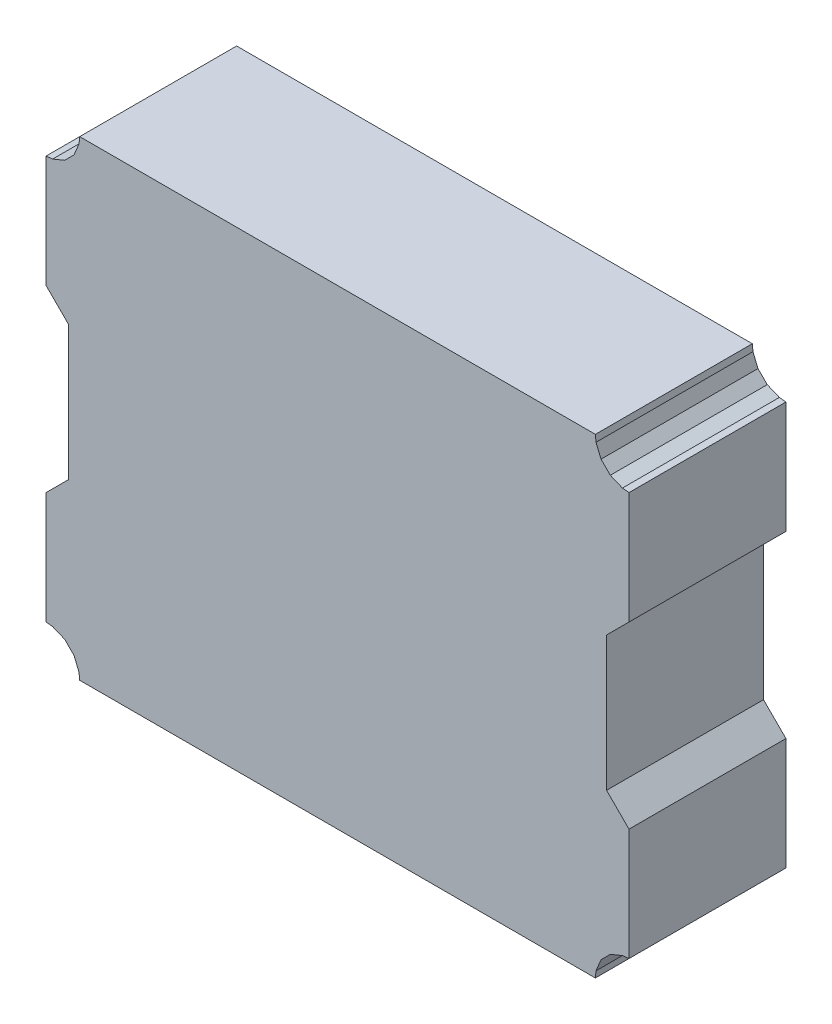
ISO-10303-21;
HEADER;
FILE_DESCRIPTION(('STEP AP214'),'2;1');
FILE_NAME('part.step','',(''),(''),'','','');
FILE_SCHEMA(('AUTOMOTIVE_DESIGN { 1 0 10303 214 1 1 1 1 }'));
ENDSEC;
DATA;
#1=APPLICATION_CONTEXT('core data for automotive mechanical design processes');
#2=APPLICATION_PROTOCOL_DEFINITION('international standard','automotive_design',2000,#1);
#3=PRODUCT_CONTEXT('',#1,'mechanical');
#4=PRODUCT('Part','Part','',(#3));
#5=PRODUCT_RELATED_PRODUCT_CATEGORY('part','',(#4));
#6=PRODUCT_DEFINITION_FORMATION('','',#4);
#7=PRODUCT_DEFINITION_CONTEXT('part definition',#1,'design');
#8=PRODUCT_DEFINITION('design','',#6,#7);
#9=PRODUCT_DEFINITION_SHAPE('','',#8);
#10=(LENGTH_UNIT() NAMED_UNIT(*) SI_UNIT(.MILLI.,.METRE.));
#11=(NAMED_UNIT(*) PLANE_ANGLE_UNIT() SI_UNIT($,.RADIAN.));
#12=(NAMED_UNIT(*) SI_UNIT($,.STERADIAN.) SOLID_ANGLE_UNIT());
#13=UNCERTAINTY_MEASURE_WITH_UNIT(LENGTH_MEASURE(1.E-05),#10,'distance_accuracy_value','');
#14=(GEOMETRIC_REPRESENTATION_CONTEXT(3) GLOBAL_UNCERTAINTY_ASSIGNED_CONTEXT((#13)) GLOBAL_UNIT_ASSIGNED_CONTEXT((#10,
#11,#12)) REPRESENTATION_CONTEXT('',''));
#15=CARTESIAN_POINT('',(0.,0.,0.));
#16=DIRECTION('',(0.,0.,1.));
#17=DIRECTION('',(1.,0.,0.));
#18=AXIS2_PLACEMENT_3D('',#15,#16,#17);
#19=CARTESIAN_POINT('',(-1.15000024,1.05000044,0.70000114));
#20=DIRECTION('',(0.,0.,1.));
#21=DIRECTION('',(1.,0.,0.));
#22=AXIS2_PLACEMENT_3D('',#19,#20,#21);
#23=PLANE('',#22);
#24=DIRECTION('',(-0.0980327133937617,-0.99518319273622,0.));
#25=VECTOR('',#24,1.);
#26=CARTESIAN_POINT('',(-1.15000024,1.05000044,0.70000114));
#27=LINE('',#26,#25);
#28=CARTESIAN_POINT('',(-1.15000024,1.05000044,0.70000114));
#29=VERTEX_POINT('',#28);
#30=CARTESIAN_POINT('',(-1.15288314,1.02073456,0.70000114));
#31=VERTEX_POINT('',#30);
#32=EDGE_CURVE('E679',#29,#31,#27,.T.);
#33=ORIENTED_EDGE('',*,*,#32,.T.);
#34=DIRECTION('',(-0.382691644263868,-0.923876130988682,0.));
#35=VECTOR('',#34,1.);
#36=CARTESIAN_POINT('',(-1.15288314,1.02073456,0.70000114));
#37=LINE('',#36,#35);
#38=CARTESIAN_POINT('',(-1.17528086,0.96666304,0.70000114));
#39=VERTEX_POINT('',#38);
#40=EDGE_CURVE('E650',#31,#39,#37,.T.);
#41=ORIENTED_EDGE('',*,*,#40,.T.);
#42=DIRECTION('',(-0.707106781185548,-0.707106781187548,0.));
#43=VECTOR('',#42,1.);
#44=CARTESIAN_POINT('',(-1.17528086,0.96666304,0.70000114));
#45=LINE('',#44,#43);
#46=CARTESIAN_POINT('',(-1.21666508,0.92527882,0.70000114));
#47=VERTEX_POINT('',#46);
#48=EDGE_CURVE('E577',#39,#47,#45,.T.);
#49=ORIENTED_EDGE('',*,*,#48,.T.);
#50=DIRECTION('',(-0.923876130989389,-0.382691644262162,0.));
#51=VECTOR('',#50,1.);
#52=CARTESIAN_POINT('',(-1.21666508,0.92527882,0.70000114));
#53=LINE('',#52,#51);
#54=CARTESIAN_POINT('',(-1.2707366,0.9028811,0.70000114));
#55=VERTEX_POINT('',#54);
#56=EDGE_CURVE('E587',#47,#55,#53,.T.);
#57=ORIENTED_EDGE('',*,*,#56,.T.);
#58=DIRECTION('',(-0.99519078692899,-0.097955589996989,0.));
#59=VECTOR('',#58,1.);
#60=CARTESIAN_POINT('',(-1.2707366,0.9028811,0.70000114));
#61=LINE('',#60,#59);
#62=CARTESIAN_POINT('',(-1.29999994,0.90000074,0.70000114));
#63=VERTEX_POINT('',#62);
#64=EDGE_CURVE('E595',#55,#63,#61,.T.);
#65=ORIENTED_EDGE('',*,*,#64,.T.);
#66=DIRECTION('',(0.,-1.,0.));
#67=VECTOR('',#66,1.);
#68=CARTESIAN_POINT('',(-1.29999994,0.90000074,0.70000114));
#69=LINE('',#68,#67);
#70=CARTESIAN_POINT('',(-1.29999994,0.3999992,0.70000114));
#71=VERTEX_POINT('',#70);
#72=EDGE_CURVE('E325',#63,#71,#69,.T.);
#73=ORIENTED_EDGE('',*,*,#72,.T.);
#74=DIRECTION('',(0.707106781186548,-0.707106781186548,0.));
#75=VECTOR('',#74,1.);
#76=CARTESIAN_POINT('',(-1.29999994,0.3999992,0.70000114));
#77=LINE('',#76,#75);
#78=CARTESIAN_POINT('',(-1.20000014,0.2999994,0.70000114));
#79=VERTEX_POINT('',#78);
#80=EDGE_CURVE('E296',#71,#79,#77,.T.);
#81=ORIENTED_EDGE('',*,*,#80,.T.);
#82=DIRECTION('',(0.,-1.,0.));
#83=VECTOR('',#82,1.);
#84=CARTESIAN_POINT('',(-1.20000014,0.2999994,0.70000114));
#85=LINE('',#84,#83);
#86=CARTESIAN_POINT('',(-1.20000014,-0.2999994,0.70000114));
#87=VERTEX_POINT('',#86);
#88=EDGE_CURVE('E317',#79,#87,#85,.T.);
#89=ORIENTED_EDGE('',*,*,#88,.T.);
#90=DIRECTION('',(-0.707106781186548,-0.707106781186548,0.));
#91=VECTOR('',#90,1.);
#92=CARTESIAN_POINT('',(-1.20000014,-0.2999994,0.70000114));
#93=LINE('',#92,#91);
#94=CARTESIAN_POINT('',(-1.29999994,-0.3999992,0.70000114));
#95=VERTEX_POINT('',#94);
#96=EDGE_CURVE('E360',#87,#95,#93,.T.);
#97=ORIENTED_EDGE('',*,*,#96,.T.);
#98=DIRECTION('',(0.,-1.,0.));
#99=VECTOR('',#98,1.);
#100=CARTESIAN_POINT('',(-1.29999994,-0.3999992,0.70000114));
#101=LINE('',#100,#99);
#102=CARTESIAN_POINT('',(-1.29999994,-0.90000074,0.70000114));
#103=VERTEX_POINT('',#102);
#104=EDGE_CURVE('E365',#95,#103,#101,.T.);
#105=ORIENTED_EDGE('',*,*,#104,.T.);
#106=DIRECTION('',(0.995182362554429,-0.0980411406532223,0.));
#107=VECTOR('',#106,1.);
#108=CARTESIAN_POINT('',(-1.29999994,-0.90000074,0.70000114));
#109=LINE('',#108,#107);
#110=CARTESIAN_POINT('',(-1.2707366,-0.90288364,0.70000114));
#111=VERTEX_POINT('',#110);
#112=EDGE_CURVE('E390',#103,#111,#109,.T.);
#113=ORIENTED_EDGE('',*,*,#112,.T.);
#114=DIRECTION('',(0.923876130988682,-0.382691644263868,0.));
#115=VECTOR('',#114,1.);
#116=CARTESIAN_POINT('',(-1.2707366,-0.90288364,0.70000114));
#117=LINE('',#116,#115);
#118=CARTESIAN_POINT('',(-1.21666508,-0.92528136,0.70000114));
#119=VERTEX_POINT('',#118);
#120=EDGE_CURVE('E402',#111,#119,#117,.T.);
#121=ORIENTED_EDGE('',*,*,#120,.T.);
#122=DIRECTION('',(0.707106781186548,-0.707106781186548,0.));
#123=VECTOR('',#122,1.);
#124=CARTESIAN_POINT('',(-1.21666508,-0.92528136,0.70000114));
#125=LINE('',#124,#123);
#126=CARTESIAN_POINT('',(-1.17528086,-0.96666558,0.70000114));
#127=VERTEX_POINT('',#126);
#128=EDGE_CURVE('E417',#119,#127,#125,.T.);
#129=ORIENTED_EDGE('',*,*,#128,.T.);
#130=DIRECTION('',(0.382691644263868,-0.923876130988682,0.));
#131=VECTOR('',#130,1.);
#132=CARTESIAN_POINT('',(-1.17528086,-0.96666558,0.70000114));
#133=LINE('',#132,#131);
#134=CARTESIAN_POINT('',(-1.15288314,-1.0207371,0.70000114));
#135=VERTEX_POINT('',#134);
#136=EDGE_CURVE('E435',#127,#135,#133,.T.);
#137=ORIENTED_EDGE('',*,*,#136,.T.);
#138=DIRECTION('',(0.0980411406532223,-0.995182362554429,0.));
#139=VECTOR('',#138,1.);
#140=CARTESIAN_POINT('',(-1.15288314,-1.0207371,0.70000114));
#141=LINE('',#140,#139);
#142=CARTESIAN_POINT('',(-1.15000024,-1.05000044,0.70000114));
#143=VERTEX_POINT('',#142);
#144=EDGE_CURVE('E447',#135,#143,#141,.T.);
#145=ORIENTED_EDGE('',*,*,#144,.T.);
#146=DIRECTION('',(1.,0.,0.));
#147=VECTOR('',#146,1.);
#148=CARTESIAN_POINT('',(-1.15000024,-1.05000044,0.70000114));
#149=LINE('',#148,#147);
#150=CARTESIAN_POINT('',(1.15000024,-1.05000044,0.70000114));
#151=VERTEX_POINT('',#150);
#152=EDGE_CURVE('E459',#143,#151,#149,.T.);
#153=ORIENTED_EDGE('',*,*,#152,.T.);
#154=DIRECTION('',(0.0979555900007426,0.99519078692862,0.));
#155=VECTOR('',#154,1.);
#156=CARTESIAN_POINT('',(1.15000024,-1.05000044,0.70000114));
#157=LINE('',#156,#155);
#158=CARTESIAN_POINT('',(1.1528806,-1.0207371,0.70000114));
#159=VERTEX_POINT('',#158);
#160=EDGE_CURVE('E346',#151,#159,#157,.T.);
#161=ORIENTED_EDGE('',*,*,#160,.T.);
#162=DIRECTION('',(0.382691644262162,0.923876130989389,0.));
#163=VECTOR('',#162,1.);
#164=CARTESIAN_POINT('',(1.1528806,-1.0207371,0.70000114));
#165=LINE('',#164,#163);
#166=CARTESIAN_POINT('',(1.17527832,-0.96666558,0.70000114));
#167=VERTEX_POINT('',#166);
#168=EDGE_CURVE('E377',#159,#167,#165,.T.);
#169=ORIENTED_EDGE('',*,*,#168,.T.);
#170=DIRECTION('',(0.707106781187548,0.707106781185548,0.));
#171=VECTOR('',#170,1.);
#172=CARTESIAN_POINT('',(1.17527832,-0.96666558,0.70000114));
#173=LINE('',#172,#171);
#174=CARTESIAN_POINT('',(1.21666254,-0.92528136,0.70000114));
#175=VERTEX_POINT('',#174);
#176=EDGE_CURVE('E487',#167,#175,#173,.T.);
#177=ORIENTED_EDGE('',*,*,#176,.T.);
#178=DIRECTION('',(0.923876130988682,0.382691644263868,0.));
#179=VECTOR('',#178,1.);
#180=CARTESIAN_POINT('',(1.21666254,-0.92528136,0.70000114));
#181=LINE('',#180,#179);
#182=CARTESIAN_POINT('',(1.27073406,-0.90288364,0.70000114));
#183=VERTEX_POINT('',#182);
#184=EDGE_CURVE('E495',#175,#183,#181,.T.);
#185=ORIENTED_EDGE('',*,*,#184,.T.);
#186=DIRECTION('',(0.99518319273622,0.0980327133937617,0.));
#187=VECTOR('',#186,1.);
#188=CARTESIAN_POINT('',(1.27073406,-0.90288364,0.70000114));
#189=LINE('',#188,#187);
#190=CARTESIAN_POINT('',(1.29999994,-0.90000074,0.70000114));
#191=VERTEX_POINT('',#190);
#192=EDGE_CURVE('E430',#183,#191,#189,.T.);
#193=ORIENTED_EDGE('',*,*,#192,.T.);
#194=DIRECTION('',(0.,1.,0.));
#195=VECTOR('',#194,1.);
#196=CARTESIAN_POINT('',(1.29999994,-0.90000074,0.70000114));
#197=LINE('',#196,#195);
#198=CARTESIAN_POINT('',(1.29999994,-0.3999992,0.70000114));
#199=VERTEX_POINT('',#198);
#200=EDGE_CURVE('E506',#191,#199,#197,.T.);
#201=ORIENTED_EDGE('',*,*,#200,.T.);
#202=DIRECTION('',(-0.707106781187048,0.707106781186048,0.));
#203=VECTOR('',#202,1.);
#204=CARTESIAN_POINT('',(1.29999994,-0.3999992,0.70000114));
#205=LINE('',#204,#203);
#206=CARTESIAN_POINT('',(1.20000014,-0.2999994,0.70000114));
#207=VERTEX_POINT('',#206);
#208=EDGE_CURVE('E334',#199,#207,#205,.T.);
#209=ORIENTED_EDGE('',*,*,#208,.T.);
#210=DIRECTION('',(0.,1.,0.));
#211=VECTOR('',#210,1.);
#212=CARTESIAN_POINT('',(1.20000014,-0.2999994,0.70000114));
#213=LINE('',#212,#211);
#214=CARTESIAN_POINT('',(1.20000014,0.2999994,0.70000114));
#215=VERTEX_POINT('',#214);
#216=EDGE_CURVE('E351',#207,#215,#213,.T.);
#217=ORIENTED_EDGE('',*,*,#216,.T.);
#218=DIRECTION('',(0.707106781187048,0.707106781186048,0.));
#219=VECTOR('',#218,1.);
#220=CARTESIAN_POINT('',(1.20000014,0.2999994,0.70000114));
#221=LINE('',#220,#219);
#222=CARTESIAN_POINT('',(1.29999994,0.3999992,0.70000114));
#223=VERTEX_POINT('',#222);
#224=EDGE_CURVE('E517',#215,#223,#221,.T.);
#225=ORIENTED_EDGE('',*,*,#224,.T.);
#226=DIRECTION('',(0.,1.,0.));
#227=VECTOR('',#226,1.);
#228=CARTESIAN_POINT('',(1.29999994,0.3999992,0.70000114));
#229=LINE('',#228,#227);
#230=CARTESIAN_POINT('',(1.29999994,0.90000074,0.70000114));
#231=VERTEX_POINT('',#230);
#232=EDGE_CURVE('E478',#223,#231,#229,.T.);
#233=ORIENTED_EDGE('',*,*,#232,.T.);
#234=DIRECTION('',(-0.995191615669597,0.0979471699485804,0.));
#235=VECTOR('',#234,1.);
#236=CARTESIAN_POINT('',(1.29999994,0.90000074,0.70000114));
#237=LINE('',#236,#235);
#238=CARTESIAN_POINT('',(1.27073406,0.9028811,0.70000114));
#239=VERTEX_POINT('',#238);
#240=EDGE_CURVE('E403',#231,#239,#237,.T.);
#241=ORIENTED_EDGE('',*,*,#240,.T.);
#242=DIRECTION('',(-0.923876130989389,0.382691644262162,0.));
#243=VECTOR('',#242,1.);
#244=CARTESIAN_POINT('',(1.27073406,0.9028811,0.70000114));
#245=LINE('',#244,#243);
#246=CARTESIAN_POINT('',(1.21666254,0.92527882,0.70000114));
#247=VERTEX_POINT('',#246);
#248=EDGE_CURVE('E539',#239,#247,#245,.T.);
#249=ORIENTED_EDGE('',*,*,#248,.T.);
#250=DIRECTION('',(-0.707106781186548,0.707106781186548,0.));
#251=VECTOR('',#250,1.);
#252=CARTESIAN_POINT('',(1.21666254,0.92527882,0.70000114));
#253=LINE('',#252,#251);
#254=CARTESIAN_POINT('',(1.17527832,0.96666304,0.70000114));
#255=VERTEX_POINT('',#254);
#256=EDGE_CURVE('E551',#247,#255,#253,.T.);
#257=ORIENTED_EDGE('',*,*,#256,.T.);
#258=DIRECTION('',(-0.382691644262162,0.923876130989389,0.));
#259=VECTOR('',#258,1.);
#260=CARTESIAN_POINT('',(1.17527832,0.96666304,0.70000114));
#261=LINE('',#260,#259);
#262=CARTESIAN_POINT('',(1.1528806,1.02073456,0.70000114));
#263=VERTEX_POINT('',#262);
#264=EDGE_CURVE('E234',#255,#263,#261,.T.);
#265=ORIENTED_EDGE('',*,*,#264,.T.);
#266=DIRECTION('',(-0.0979471699525305,0.995191615669209,0.));
#267=VECTOR('',#266,1.);
#268=CARTESIAN_POINT('',(1.1528806,1.02073456,0.70000114));
#269=LINE('',#268,#267);
#270=CARTESIAN_POINT('',(1.15000024,1.05000044,0.70000114));
#271=VERTEX_POINT('',#270);
#272=EDGE_CURVE('E562',#263,#271,#269,.T.);
#273=ORIENTED_EDGE('',*,*,#272,.T.);
#274=DIRECTION('',(-1.,0.,0.));
#275=VECTOR('',#274,1.);
#276=CARTESIAN_POINT('',(1.15000024,1.05000044,0.70000114));
#277=LINE('',#276,#275);
#278=EDGE_CURVE('E11',#271,#29,#277,.T.);
#279=ORIENTED_EDGE('',*,*,#278,.T.);
#280=EDGE_LOOP('',(#33,#41,#49,#57,#65,#73,#81,#89,#97,#105,#113,#121,#129,#137,#145,#153,#161,
#169,#177,#185,#193,#201,#209,#217,#225,#233,#241,#249,#257,#265,#273,#279));
#281=FACE_BOUND('',#280,.T.);
#282=ADVANCED_FACE('F17',(#281),#23,.T.);
#283=CARTESIAN_POINT('',(-1.15000024,1.05000044,0.));
#284=DIRECTION('',(0.,0.,1.));
#285=DIRECTION('',(1.,0.,0.));
#286=AXIS2_PLACEMENT_3D('',#283,#284,#285);
#287=PLANE('',#286);
#288=DIRECTION('',(-1.,0.,0.));
#289=VECTOR('',#288,1.);
#290=CARTESIAN_POINT('',(1.15000024,1.05000044,0.));
#291=LINE('',#290,#289);
#292=CARTESIAN_POINT('',(1.15000024,1.05000044,0.));
#293=VERTEX_POINT('',#292);
#294=CARTESIAN_POINT('',(-1.15000024,1.05000044,0.));
#295=VERTEX_POINT('',#294);
#296=EDGE_CURVE('E25',#293,#295,#291,.T.);
#297=ORIENTED_EDGE('',*,*,#296,.F.);
#298=DIRECTION('',(-0.0979471699525305,0.995191615669209,0.));
#299=VECTOR('',#298,1.);
#300=CARTESIAN_POINT('',(1.1528806,1.02073456,0.));
#301=LINE('',#300,#299);
#302=CARTESIAN_POINT('',(1.1528806,1.02073456,0.));
#303=VERTEX_POINT('',#302);
#304=EDGE_CURVE('E242',#303,#293,#301,.T.);
#305=ORIENTED_EDGE('',*,*,#304,.F.);
#306=DIRECTION('',(-0.382691644262162,0.923876130989389,0.));
#307=VECTOR('',#306,1.);
#308=CARTESIAN_POINT('',(1.17527832,0.96666304,0.));
#309=LINE('',#308,#307);
#310=CARTESIAN_POINT('',(1.17527832,0.96666304,0.));
#311=VERTEX_POINT('',#310);
#312=EDGE_CURVE('E554',#311,#303,#309,.T.);
#313=ORIENTED_EDGE('',*,*,#312,.F.);
#314=DIRECTION('',(-0.707106781186548,0.707106781186548,0.));
#315=VECTOR('',#314,1.);
#316=CARTESIAN_POINT('',(1.21666254,0.92527882,0.));
#317=LINE('',#316,#315);
#318=CARTESIAN_POINT('',(1.21666254,0.92527882,0.));
#319=VERTEX_POINT('',#318);
#320=EDGE_CURVE('E543',#319,#311,#317,.T.);
#321=ORIENTED_EDGE('',*,*,#320,.F.);
#322=DIRECTION('',(-0.923876130989389,0.382691644262162,0.));
#323=VECTOR('',#322,1.);
#324=CARTESIAN_POINT('',(1.27073406,0.9028811,0.));
#325=LINE('',#324,#323);
#326=CARTESIAN_POINT('',(1.27073406,0.9028811,0.));
#327=VERTEX_POINT('',#326);
#328=EDGE_CURVE('E407',#327,#319,#325,.T.);
#329=ORIENTED_EDGE('',*,*,#328,.F.);
#330=DIRECTION('',(-0.995191615669597,0.0979471699485804,0.));
#331=VECTOR('',#330,1.);
#332=CARTESIAN_POINT('',(1.29999994,0.90000074,0.));
#333=LINE('',#332,#331);
#334=CARTESIAN_POINT('',(1.29999994,0.90000074,0.));
#335=VERTEX_POINT('',#334);
#336=EDGE_CURVE('E482',#335,#327,#333,.T.);
#337=ORIENTED_EDGE('',*,*,#336,.F.);
#338=DIRECTION('',(0.,1.,0.));
#339=VECTOR('',#338,1.);
#340=CARTESIAN_POINT('',(1.29999994,0.3999992,0.));
#341=LINE('',#340,#339);
#342=CARTESIAN_POINT('',(1.29999994,0.3999992,0.));
#343=VERTEX_POINT('',#342);
#344=EDGE_CURVE('E521',#343,#335,#341,.T.);
#345=ORIENTED_EDGE('',*,*,#344,.F.);
#346=DIRECTION('',(0.707106781187048,0.707106781186048,0.));
#347=VECTOR('',#346,1.);
#348=CARTESIAN_POINT('',(1.20000014,0.2999994,0.));
#349=LINE('',#348,#347);
#350=CARTESIAN_POINT('',(1.20000014,0.2999994,0.));
#351=VERTEX_POINT('',#350);
#352=EDGE_CURVE('E355',#351,#343,#349,.T.);
#353=ORIENTED_EDGE('',*,*,#352,.F.);
#354=DIRECTION('',(0.,1.,0.));
#355=VECTOR('',#354,1.);
#356=CARTESIAN_POINT('',(1.20000014,-0.2999994,0.));
#357=LINE('',#356,#355);
#358=CARTESIAN_POINT('',(1.20000014,-0.2999994,0.));
#359=VERTEX_POINT('',#358);
#360=EDGE_CURVE('E337',#359,#351,#357,.T.);
#361=ORIENTED_EDGE('',*,*,#360,.F.);
#362=DIRECTION('',(-0.707106781187048,0.707106781186048,0.));
#363=VECTOR('',#362,1.);
#364=CARTESIAN_POINT('',(1.29999994,-0.3999992,0.));
#365=LINE('',#364,#363);
#366=CARTESIAN_POINT('',(1.29999994,-0.3999992,0.));
#367=VERTEX_POINT('',#366);
#368=EDGE_CURVE('E507',#367,#359,#365,.T.);
#369=ORIENTED_EDGE('',*,*,#368,.F.);
#370=DIRECTION('',(0.,1.,0.));
#371=VECTOR('',#370,1.);
#372=CARTESIAN_POINT('',(1.29999994,-0.90000074,0.));
#373=LINE('',#372,#371);
#374=CARTESIAN_POINT('',(1.29999994,-0.90000074,0.));
#375=VERTEX_POINT('',#374);
#376=EDGE_CURVE('E466',#375,#367,#373,.T.);
#377=ORIENTED_EDGE('',*,*,#376,.F.);
#378=DIRECTION('',(0.99518319273622,0.0980327133937617,0.));
#379=VECTOR('',#378,1.);
#380=CARTESIAN_POINT('',(1.27073406,-0.90288364,0.));
#381=LINE('',#380,#379);
#382=CARTESIAN_POINT('',(1.27073406,-0.90288364,0.));
#383=VERTEX_POINT('',#382);
#384=EDGE_CURVE('E431',#383,#375,#381,.T.);
#385=ORIENTED_EDGE('',*,*,#384,.F.);
#386=DIRECTION('',(0.923876130988682,0.382691644263868,0.));
#387=VECTOR('',#386,1.);
#388=CARTESIAN_POINT('',(1.21666254,-0.92528136,0.));
#389=LINE('',#388,#387);
#390=CARTESIAN_POINT('',(1.21666254,-0.92528136,0.));
#391=VERTEX_POINT('',#390);
#392=EDGE_CURVE('E491',#391,#383,#389,.T.);
#393=ORIENTED_EDGE('',*,*,#392,.F.);
#394=DIRECTION('',(0.707106781187548,0.707106781185548,0.));
#395=VECTOR('',#394,1.);
#396=CARTESIAN_POINT('',(1.17527832,-0.96666558,0.));
#397=LINE('',#396,#395);
#398=CARTESIAN_POINT('',(1.17527832,-0.96666558,0.));
#399=VERTEX_POINT('',#398);
#400=EDGE_CURVE('E473',#399,#391,#397,.T.);
#401=ORIENTED_EDGE('',*,*,#400,.F.);
#402=DIRECTION('',(0.382691644262162,0.923876130989389,0.));
#403=VECTOR('',#402,1.);
#404=CARTESIAN_POINT('',(1.1528806,-1.0207371,0.));
#405=LINE('',#404,#403);
#406=CARTESIAN_POINT('',(1.1528806,-1.0207371,0.));
#407=VERTEX_POINT('',#406);
#408=EDGE_CURVE('E378',#407,#399,#405,.T.);
#409=ORIENTED_EDGE('',*,*,#408,.F.);
#410=DIRECTION('',(0.0979555900007426,0.99519078692862,0.));
#411=VECTOR('',#410,1.);
#412=CARTESIAN_POINT('',(1.15000024,-1.05000044,0.));
#413=LINE('',#412,#411);
#414=CARTESIAN_POINT('',(1.15000024,-1.05000044,0.));
#415=VERTEX_POINT('',#414);
#416=EDGE_CURVE('E347',#415,#407,#413,.T.);
#417=ORIENTED_EDGE('',*,*,#416,.F.);
#418=DIRECTION('',(1.,0.,0.));
#419=VECTOR('',#418,1.);
#420=CARTESIAN_POINT('',(-1.15000024,-1.05000044,0.));
#421=LINE('',#420,#419);
#422=CARTESIAN_POINT('',(-1.15000024,-1.05000044,0.));
#423=VERTEX_POINT('',#422);
#424=EDGE_CURVE('E451',#423,#415,#421,.T.);
#425=ORIENTED_EDGE('',*,*,#424,.F.);
#426=DIRECTION('',(0.0980411406532223,-0.995182362554429,0.));
#427=VECTOR('',#426,1.);
#428=CARTESIAN_POINT('',(-1.15288314,-1.0207371,0.));
#429=LINE('',#428,#427);
#430=CARTESIAN_POINT('',(-1.15288314,-1.0207371,0.));
#431=VERTEX_POINT('',#430);
#432=EDGE_CURVE('E439',#431,#423,#429,.T.);
#433=ORIENTED_EDGE('',*,*,#432,.F.);
#434=DIRECTION('',(0.382691644263868,-0.923876130988682,0.));
#435=VECTOR('',#434,1.);
#436=CARTESIAN_POINT('',(-1.17528086,-0.96666558,0.));
#437=LINE('',#436,#435);
#438=CARTESIAN_POINT('',(-1.17528086,-0.96666558,0.));
#439=VERTEX_POINT('',#438);
#440=EDGE_CURVE('E421',#439,#431,#437,.T.);
#441=ORIENTED_EDGE('',*,*,#440,.F.);
#442=DIRECTION('',(0.707106781186548,-0.707106781186548,0.));
#443=VECTOR('',#442,1.);
#444=CARTESIAN_POINT('',(-1.21666508,-0.92528136,0.));
#445=LINE('',#444,#443);
#446=CARTESIAN_POINT('',(-1.21666508,-0.92528136,0.));
#447=VERTEX_POINT('',#446);
#448=EDGE_CURVE('E412',#447,#439,#445,.T.);
#449=ORIENTED_EDGE('',*,*,#448,.F.);
#450=DIRECTION('',(0.923876130988682,-0.382691644263868,0.));
#451=VECTOR('',#450,1.);
#452=CARTESIAN_POINT('',(-1.2707366,-0.90288364,0.));
#453=LINE('',#452,#451);
#454=CARTESIAN_POINT('',(-1.2707366,-0.90288364,0.));
#455=VERTEX_POINT('',#454);
#456=EDGE_CURVE('E394',#455,#447,#453,.T.);
#457=ORIENTED_EDGE('',*,*,#456,.F.);
#458=DIRECTION('',(0.995182362554429,-0.0980411406532223,0.));
#459=VECTOR('',#458,1.);
#460=CARTESIAN_POINT('',(-1.29999994,-0.90000074,0.));
#461=LINE('',#460,#459);
#462=CARTESIAN_POINT('',(-1.29999994,-0.90000074,0.));
#463=VERTEX_POINT('',#462);
#464=EDGE_CURVE('E382',#463,#455,#461,.T.);
#465=ORIENTED_EDGE('',*,*,#464,.F.);
#466=DIRECTION('',(0.,-1.,0.));
#467=VECTOR('',#466,1.);
#468=CARTESIAN_POINT('',(-1.29999994,-0.3999992,0.));
#469=LINE('',#468,#467);
#470=CARTESIAN_POINT('',(-1.29999994,-0.3999992,0.));
#471=VERTEX_POINT('',#470);
#472=EDGE_CURVE('E366',#471,#463,#469,.T.);
#473=ORIENTED_EDGE('',*,*,#472,.F.);
#474=DIRECTION('',(-0.707106781186548,-0.707106781186548,0.));
#475=VECTOR('',#474,1.);
#476=CARTESIAN_POINT('',(-1.20000014,-0.2999994,0.));
#477=LINE('',#476,#475);
#478=CARTESIAN_POINT('',(-1.20000014,-0.2999994,0.));
#479=VERTEX_POINT('',#478);
#480=EDGE_CURVE('E307',#479,#471,#477,.T.);
#481=ORIENTED_EDGE('',*,*,#480,.F.);
#482=DIRECTION('',(0.,-1.,0.));
#483=VECTOR('',#482,1.);
#484=CARTESIAN_POINT('',(-1.20000014,0.2999994,0.));
#485=LINE('',#484,#483);
#486=CARTESIAN_POINT('',(-1.20000014,0.2999994,0.));
#487=VERTEX_POINT('',#486);
#488=EDGE_CURVE('E301',#487,#479,#485,.T.);
#489=ORIENTED_EDGE('',*,*,#488,.F.);
#490=DIRECTION('',(0.707106781186548,-0.707106781186548,0.));
#491=VECTOR('',#490,1.);
#492=CARTESIAN_POINT('',(-1.29999994,0.3999992,0.));
#493=LINE('',#492,#491);
#494=CARTESIAN_POINT('',(-1.29999994,0.3999992,0.));
#495=VERTEX_POINT('',#494);
#496=EDGE_CURVE('E305',#495,#487,#493,.T.);
#497=ORIENTED_EDGE('',*,*,#496,.F.);
#498=DIRECTION('',(0.,-1.,0.));
#499=VECTOR('',#498,1.);
#500=CARTESIAN_POINT('',(-1.29999994,0.90000074,0.));
#501=LINE('',#500,#499);
#502=CARTESIAN_POINT('',(-1.29999994,0.90000074,0.));
#503=VERTEX_POINT('',#502);
#504=EDGE_CURVE('E599',#503,#495,#501,.T.);
#505=ORIENTED_EDGE('',*,*,#504,.F.);
#506=DIRECTION('',(-0.99519078692899,-0.097955589996989,0.));
#507=VECTOR('',#506,1.);
#508=CARTESIAN_POINT('',(-1.2707366,0.9028811,0.));
#509=LINE('',#508,#507);
#510=CARTESIAN_POINT('',(-1.2707366,0.9028811,0.));
#511=VERTEX_POINT('',#510);
#512=EDGE_CURVE('E591',#511,#503,#509,.T.);
#513=ORIENTED_EDGE('',*,*,#512,.F.);
#514=DIRECTION('',(-0.923876130989389,-0.382691644262162,0.));
#515=VECTOR('',#514,1.);
#516=CARTESIAN_POINT('',(-1.21666508,0.92527882,0.));
#517=LINE('',#516,#515);
#518=CARTESIAN_POINT('',(-1.21666508,0.92527882,0.));
#519=VERTEX_POINT('',#518);
#520=EDGE_CURVE('E581',#519,#511,#517,.T.);
#521=ORIENTED_EDGE('',*,*,#520,.F.);
#522=DIRECTION('',(-0.707106781185548,-0.707106781187548,0.));
#523=VECTOR('',#522,1.);
#524=CARTESIAN_POINT('',(-1.17528086,0.96666304,0.));
#525=LINE('',#524,#523);
#526=CARTESIAN_POINT('',(-1.17528086,0.96666304,0.));
#527=VERTEX_POINT('',#526);
#528=EDGE_CURVE('E647',#527,#519,#525,.T.);
#529=ORIENTED_EDGE('',*,*,#528,.F.);
#530=DIRECTION('',(-0.382691644263868,-0.923876130988682,0.));
#531=VECTOR('',#530,1.);
#532=CARTESIAN_POINT('',(-1.15288314,1.02073456,0.));
#533=LINE('',#532,#531);
#534=CARTESIAN_POINT('',(-1.15288314,1.02073456,0.));
#535=VERTEX_POINT('',#534);
#536=EDGE_CURVE('E640',#535,#527,#533,.T.);
#537=ORIENTED_EDGE('',*,*,#536,.F.);
#538=DIRECTION('',(-0.0980327133937617,-0.99518319273622,0.));
#539=VECTOR('',#538,1.);
#540=CARTESIAN_POINT('',(-1.15000024,1.05000044,0.));
#541=LINE('',#540,#539);
#542=EDGE_CURVE('E668',#295,#535,#541,.T.);
#543=ORIENTED_EDGE('',*,*,#542,.F.);
#544=EDGE_LOOP('',(#297,#305,#313,#321,#329,#337,#345,#353,#361,#369,#377,#385,#393,#401,#409,
#417,#425,#433,#441,#449,#457,#465,#473,#481,#489,#497,#505,#513,#521,#529,#537,#543));
#545=FACE_BOUND('',#544,.T.);
#546=ADVANCED_FACE('F303',(#545),#287,.F.);
#547=CARTESIAN_POINT('',(1.15000024,1.05000044,0.));
#548=DIRECTION('',(0.,-1.,0.));
#549=DIRECTION('',(0.,0.,-1.));
#550=AXIS2_PLACEMENT_3D('',#547,#548,#549);
#551=PLANE('',#550);
#552=ORIENTED_EDGE('',*,*,#296,.T.);
#553=DIRECTION('',(0.,0.,1.));
#554=VECTOR('',#553,1.);
#555=CARTESIAN_POINT('',(-1.15000024,1.05000044,0.));
#556=LINE('',#555,#554);
#557=EDGE_CURVE('E644',#295,#29,#556,.T.);
#558=ORIENTED_EDGE('',*,*,#557,.T.);
#559=ORIENTED_EDGE('',*,*,#278,.F.);
#560=DIRECTION('',(0.,0.,1.));
#561=VECTOR('',#560,1.);
#562=CARTESIAN_POINT('',(1.15000024,1.05000044,0.));
#563=LINE('',#562,#561);
#564=EDGE_CURVE('E542',#293,#271,#563,.T.);
#565=ORIENTED_EDGE('',*,*,#564,.F.);
#566=EDGE_LOOP('',(#552,#558,#559,#565));
#567=FACE_BOUND('',#566,.T.);
#568=ADVANCED_FACE('F1223',(#567),#551,.F.);
#569=CARTESIAN_POINT('',(1.1528806,1.02073456,0.));
#570=DIRECTION('',(-0.995191615669209,-0.0979471699525305,0.));
#571=DIRECTION('',(-0.0979471699525305,0.995191615669209,0.));
#572=AXIS2_PLACEMENT_3D('',#569,#570,#571);
#573=PLANE('',#572);
#574=ORIENTED_EDGE('',*,*,#304,.T.);
#575=ORIENTED_EDGE('',*,*,#564,.T.);
#576=ORIENTED_EDGE('',*,*,#272,.F.);
#577=DIRECTION('',(0.,0.,1.));
#578=VECTOR('',#577,1.);
#579=CARTESIAN_POINT('',(1.1528806,1.02073456,0.));
#580=LINE('',#579,#578);
#581=EDGE_CURVE('E555',#303,#263,#580,.T.);
#582=ORIENTED_EDGE('',*,*,#581,.F.);
#583=EDGE_LOOP('',(#574,#575,#576,#582));
#584=FACE_BOUND('',#583,.T.);
#585=ADVANCED_FACE('F1163',(#584),#573,.F.);
#586=CARTESIAN_POINT('',(1.17527832,0.96666304,0.));
#587=DIRECTION('',(-0.923876130989389,-0.382691644262162,0.));
#588=DIRECTION('',(-0.382691644262162,0.923876130989389,0.));
#589=AXIS2_PLACEMENT_3D('',#586,#587,#588);
#590=PLANE('',#589);
#591=ORIENTED_EDGE('',*,*,#312,.T.);
#592=ORIENTED_EDGE('',*,*,#581,.T.);
#593=ORIENTED_EDGE('',*,*,#264,.F.);
#594=DIRECTION('',(0.,0.,1.));
#595=VECTOR('',#594,1.);
#596=CARTESIAN_POINT('',(1.17527832,0.96666304,0.));
#597=LINE('',#596,#595);
#598=EDGE_CURVE('E547',#311,#255,#597,.T.);
#599=ORIENTED_EDGE('',*,*,#598,.F.);
#600=EDGE_LOOP('',(#591,#592,#593,#599));
#601=FACE_BOUND('',#600,.T.);
#602=ADVANCED_FACE('F742',(#601),#590,.F.);
#603=CARTESIAN_POINT('',(1.21666254,0.92527882,0.));
#604=DIRECTION('',(-0.707106781186548,-0.707106781186548,0.));
#605=DIRECTION('',(-0.707106781186548,0.707106781186548,0.));
#606=AXIS2_PLACEMENT_3D('',#603,#604,#605);
#607=PLANE('',#606);
#608=ORIENTED_EDGE('',*,*,#320,.T.);
#609=ORIENTED_EDGE('',*,*,#598,.T.);
#610=ORIENTED_EDGE('',*,*,#256,.F.);
#611=DIRECTION('',(0.,0.,1.));
#612=VECTOR('',#611,1.);
#613=CARTESIAN_POINT('',(1.21666254,0.92527882,0.));
#614=LINE('',#613,#612);
#615=EDGE_CURVE('E526',#319,#247,#614,.T.);
#616=ORIENTED_EDGE('',*,*,#615,.F.);
#617=EDGE_LOOP('',(#608,#609,#610,#616));
#618=FACE_BOUND('',#617,.T.);
#619=ADVANCED_FACE('F741',(#618),#607,.F.);
#620=CARTESIAN_POINT('',(1.27073406,0.9028811,0.));
#621=DIRECTION('',(-0.382691644262162,-0.923876130989389,0.));
#622=DIRECTION('',(-0.923876130989389,0.382691644262162,0.));
#623=AXIS2_PLACEMENT_3D('',#620,#621,#622);
#624=PLANE('',#623);
#625=ORIENTED_EDGE('',*,*,#328,.T.);
#626=ORIENTED_EDGE('',*,*,#615,.T.);
#627=ORIENTED_EDGE('',*,*,#248,.F.);
#628=DIRECTION('',(0.,0.,1.));
#629=VECTOR('',#628,1.);
#630=CARTESIAN_POINT('',(1.27073406,0.9028811,0.));
#631=LINE('',#630,#629);
#632=EDGE_CURVE('E408',#327,#239,#631,.T.);
#633=ORIENTED_EDGE('',*,*,#632,.F.);
#634=EDGE_LOOP('',(#625,#626,#627,#633));
#635=FACE_BOUND('',#634,.T.);
#636=ADVANCED_FACE('F738',(#635),#624,.F.);
#637=CARTESIAN_POINT('',(1.29999994,0.90000074,0.));
#638=DIRECTION('',(-0.0979471699485804,-0.995191615669597,0.));
#639=DIRECTION('',(-0.995191615669597,0.0979471699485804,0.));
#640=AXIS2_PLACEMENT_3D('',#637,#638,#639);
#641=PLANE('',#640);
#642=ORIENTED_EDGE('',*,*,#336,.T.);
#643=ORIENTED_EDGE('',*,*,#632,.T.);
#644=ORIENTED_EDGE('',*,*,#240,.F.);
#645=DIRECTION('',(0.,0.,1.));
#646=VECTOR('',#645,1.);
#647=CARTESIAN_POINT('',(1.29999994,0.90000074,0.));
#648=LINE('',#647,#646);
#649=EDGE_CURVE('E483',#335,#231,#648,.T.);
#650=ORIENTED_EDGE('',*,*,#649,.F.);
#651=EDGE_LOOP('',(#642,#643,#644,#650));
#652=FACE_BOUND('',#651,.T.);
#653=ADVANCED_FACE('F735',(#652),#641,.F.);
#654=CARTESIAN_POINT('',(1.29999994,0.3999992,0.));
#655=DIRECTION('',(-1.,0.,0.));
#656=DIRECTION('',(0.,0.,1.));
#657=AXIS2_PLACEMENT_3D('',#654,#655,#656);
#658=PLANE('',#657);
#659=ORIENTED_EDGE('',*,*,#344,.T.);
#660=ORIENTED_EDGE('',*,*,#649,.T.);
#661=ORIENTED_EDGE('',*,*,#232,.F.);
#662=DIRECTION('',(0.,0.,1.));
#663=VECTOR('',#662,1.);
#664=CARTESIAN_POINT('',(1.29999994,0.3999992,0.));
#665=LINE('',#664,#663);
#666=EDGE_CURVE('E522',#343,#223,#665,.T.);
#667=ORIENTED_EDGE('',*,*,#666,.F.);
#668=EDGE_LOOP('',(#659,#660,#661,#667));
#669=FACE_BOUND('',#668,.T.);
#670=ADVANCED_FACE('F733',(#669),#658,.F.);
#671=CARTESIAN_POINT('',(1.20000014,0.2999994,0.));
#672=DIRECTION('',(-0.707106781186048,0.707106781187048,0.));
#673=DIRECTION('',(0.,0.,1.));
#674=AXIS2_PLACEMENT_3D('',#671,#672,#673);
#675=PLANE('',#674);
#676=ORIENTED_EDGE('',*,*,#352,.T.);
#677=ORIENTED_EDGE('',*,*,#666,.T.);
#678=ORIENTED_EDGE('',*,*,#224,.F.);
#679=DIRECTION('',(0.,0.,1.));
#680=VECTOR('',#679,1.);
#681=CARTESIAN_POINT('',(1.20000014,0.2999994,0.));
#682=LINE('',#681,#680);
#683=EDGE_CURVE('E356',#351,#215,#682,.T.);
#684=ORIENTED_EDGE('',*,*,#683,.F.);
#685=EDGE_LOOP('',(#676,#677,#678,#684));
#686=FACE_BOUND('',#685,.T.);
#687=ADVANCED_FACE('F729',(#686),#675,.F.);
#688=CARTESIAN_POINT('',(1.20000014,-0.2999994,0.));
#689=DIRECTION('',(-1.,0.,0.));
#690=DIRECTION('',(0.,0.,1.));
#691=AXIS2_PLACEMENT_3D('',#688,#689,#690);
#692=PLANE('',#691);
#693=ORIENTED_EDGE('',*,*,#360,.T.);
#694=ORIENTED_EDGE('',*,*,#683,.T.);
#695=ORIENTED_EDGE('',*,*,#216,.F.);
#696=DIRECTION('',(0.,0.,1.));
#697=VECTOR('',#696,1.);
#698=CARTESIAN_POINT('',(1.20000014,-0.2999994,0.));
#699=LINE('',#698,#697);
#700=EDGE_CURVE('E338',#359,#207,#699,.T.);
#701=ORIENTED_EDGE('',*,*,#700,.F.);
#702=EDGE_LOOP('',(#693,#694,#695,#701));
#703=FACE_BOUND('',#702,.T.);
#704=ADVANCED_FACE('F726',(#703),#692,.F.);
#705=CARTESIAN_POINT('',(1.29999994,-0.3999992,0.));
#706=DIRECTION('',(-0.707106781186048,-0.707106781187048,0.));
#707=DIRECTION('',(-0.707106781187048,0.707106781186048,0.));
#708=AXIS2_PLACEMENT_3D('',#705,#706,#707);
#709=PLANE('',#708);
#710=ORIENTED_EDGE('',*,*,#368,.T.);
#711=ORIENTED_EDGE('',*,*,#700,.T.);
#712=ORIENTED_EDGE('',*,*,#208,.F.);
#713=DIRECTION('',(0.,0.,1.));
#714=VECTOR('',#713,1.);
#715=CARTESIAN_POINT('',(1.29999994,-0.3999992,0.));
#716=LINE('',#715,#714);
#717=EDGE_CURVE('E502',#367,#199,#716,.T.);
#718=ORIENTED_EDGE('',*,*,#717,.F.);
#719=EDGE_LOOP('',(#710,#711,#712,#718));
#720=FACE_BOUND('',#719,.T.);
#721=ADVANCED_FACE('F724',(#720),#709,.F.);
#722=CARTESIAN_POINT('',(1.29999994,-0.90000074,0.));
#723=DIRECTION('',(-1.,0.,0.));
#724=DIRECTION('',(0.,0.,1.));
#725=AXIS2_PLACEMENT_3D('',#722,#723,#724);
#726=PLANE('',#725);
#727=ORIENTED_EDGE('',*,*,#376,.T.);
#728=ORIENTED_EDGE('',*,*,#717,.T.);
#729=ORIENTED_EDGE('',*,*,#200,.F.);
#730=DIRECTION('',(0.,0.,1.));
#731=VECTOR('',#730,1.);
#732=CARTESIAN_POINT('',(1.29999994,-0.90000074,0.));
#733=LINE('',#732,#731);
#734=EDGE_CURVE('E426',#375,#191,#733,.T.);
#735=ORIENTED_EDGE('',*,*,#734,.F.);
#736=EDGE_LOOP('',(#727,#728,#729,#735));
#737=FACE_BOUND('',#736,.T.);
#738=ADVANCED_FACE('F720',(#737),#726,.F.);
#739=CARTESIAN_POINT('',(1.27073406,-0.90288364,0.));
#740=DIRECTION('',(-0.0980327133937617,0.99518319273622,0.));
#741=DIRECTION('',(0.,0.,1.));
#742=AXIS2_PLACEMENT_3D('',#739,#740,#741);
#743=PLANE('',#742);
#744=ORIENTED_EDGE('',*,*,#384,.T.);
#745=ORIENTED_EDGE('',*,*,#734,.T.);
#746=ORIENTED_EDGE('',*,*,#192,.F.);
#747=DIRECTION('',(0.,0.,1.));
#748=VECTOR('',#747,1.);
#749=CARTESIAN_POINT('',(1.27073406,-0.90288364,0.));
#750=LINE('',#749,#748);
#751=EDGE_CURVE('E583',#383,#183,#750,.T.);
#752=ORIENTED_EDGE('',*,*,#751,.F.);
#753=EDGE_LOOP('',(#744,#745,#746,#752));
#754=FACE_BOUND('',#753,.T.);
#755=ADVANCED_FACE('F717',(#754),#743,.F.);
#756=CARTESIAN_POINT('',(1.21666254,-0.92528136,0.));
#757=DIRECTION('',(-0.382691644263868,0.923876130988682,0.));
#758=DIRECTION('',(0.,0.,1.));
#759=AXIS2_PLACEMENT_3D('',#756,#757,#758);
#760=PLANE('',#759);
#761=ORIENTED_EDGE('',*,*,#392,.T.);
#762=ORIENTED_EDGE('',*,*,#751,.T.);
#763=ORIENTED_EDGE('',*,*,#184,.F.);
#764=DIRECTION('',(0.,0.,1.));
#765=VECTOR('',#764,1.);
#766=CARTESIAN_POINT('',(1.21666254,-0.92528136,0.));
#767=LINE('',#766,#765);
#768=EDGE_CURVE('E477',#391,#175,#767,.T.);
#769=ORIENTED_EDGE('',*,*,#768,.F.);
#770=EDGE_LOOP('',(#761,#762,#763,#769));
#771=FACE_BOUND('',#770,.T.);
#772=ADVANCED_FACE('F715',(#771),#760,.F.);
#773=CARTESIAN_POINT('',(1.17527832,-0.96666558,0.));
#774=DIRECTION('',(-0.707106781185548,0.707106781187548,0.));
#775=DIRECTION('',(0.,0.,1.));
#776=AXIS2_PLACEMENT_3D('',#773,#774,#775);
#777=PLANE('',#776);
#778=ORIENTED_EDGE('',*,*,#400,.T.);
#779=ORIENTED_EDGE('',*,*,#768,.T.);
#780=ORIENTED_EDGE('',*,*,#176,.F.);
#781=DIRECTION('',(0.,0.,1.));
#782=VECTOR('',#781,1.);
#783=CARTESIAN_POINT('',(1.17527832,-0.96666558,0.));
#784=LINE('',#783,#782);
#785=EDGE_CURVE('E373',#399,#167,#784,.T.);
#786=ORIENTED_EDGE('',*,*,#785,.F.);
#787=EDGE_LOOP('',(#778,#779,#780,#786));
#788=FACE_BOUND('',#787,.T.);
#789=ADVANCED_FACE('F745',(#788),#777,.F.);
#790=CARTESIAN_POINT('',(1.1528806,-1.0207371,0.));
#791=DIRECTION('',(-0.923876130989389,0.382691644262162,0.));
#792=DIRECTION('',(0.,0.,1.));
#793=AXIS2_PLACEMENT_3D('',#790,#791,#792);
#794=PLANE('',#793);
#795=ORIENTED_EDGE('',*,*,#408,.T.);
#796=ORIENTED_EDGE('',*,*,#785,.T.);
#797=ORIENTED_EDGE('',*,*,#168,.F.);
#798=DIRECTION('',(0.,0.,1.));
#799=VECTOR('',#798,1.);
#800=CARTESIAN_POINT('',(1.1528806,-1.0207371,0.));
#801=LINE('',#800,#799);
#802=EDGE_CURVE('E342',#407,#159,#801,.T.);
#803=ORIENTED_EDGE('',*,*,#802,.F.);
#804=EDGE_LOOP('',(#795,#796,#797,#803));
#805=FACE_BOUND('',#804,.T.);
#806=ADVANCED_FACE('F748',(#805),#794,.F.);
#807=CARTESIAN_POINT('',(1.15000024,-1.05000044,0.));
#808=DIRECTION('',(-0.99519078692862,0.0979555900007426,0.));
#809=DIRECTION('',(0.,0.,1.));
#810=AXIS2_PLACEMENT_3D('',#807,#808,#809);
#811=PLANE('',#810);
#812=ORIENTED_EDGE('',*,*,#416,.T.);
#813=ORIENTED_EDGE('',*,*,#802,.T.);
#814=ORIENTED_EDGE('',*,*,#160,.F.);
#815=DIRECTION('',(0.,0.,1.));
#816=VECTOR('',#815,1.);
#817=CARTESIAN_POINT('',(1.15000024,-1.05000044,0.));
#818=LINE('',#817,#816);
#819=EDGE_CURVE('E455',#415,#151,#818,.T.);
#820=ORIENTED_EDGE('',*,*,#819,.F.);
#821=EDGE_LOOP('',(#812,#813,#814,#820));
#822=FACE_BOUND('',#821,.T.);
#823=ADVANCED_FACE('F752',(#822),#811,.F.);
#824=CARTESIAN_POINT('',(-1.15000024,-1.05000044,0.));
#825=DIRECTION('',(0.,1.,0.));
#826=DIRECTION('',(1.,0.,0.));
#827=AXIS2_PLACEMENT_3D('',#824,#825,#826);
#828=PLANE('',#827);
#829=ORIENTED_EDGE('',*,*,#424,.T.);
#830=ORIENTED_EDGE('',*,*,#819,.T.);
#831=ORIENTED_EDGE('',*,*,#152,.F.);
#832=DIRECTION('',(0.,0.,1.));
#833=VECTOR('',#832,1.);
#834=CARTESIAN_POINT('',(-1.15000024,-1.05000044,0.));
#835=LINE('',#834,#833);
#836=EDGE_CURVE('E443',#423,#143,#835,.T.);
#837=ORIENTED_EDGE('',*,*,#836,.F.);
#838=EDGE_LOOP('',(#829,#830,#831,#837));
#839=FACE_BOUND('',#838,.T.);
#840=ADVANCED_FACE('F754',(#839),#828,.F.);
#841=CARTESIAN_POINT('',(-1.15288314,-1.0207371,0.));
#842=DIRECTION('',(0.995182362554429,0.0980411406532223,0.));
#843=DIRECTION('',(0.,0.,-1.));
#844=AXIS2_PLACEMENT_3D('',#841,#842,#843);
#845=PLANE('',#844);
#846=ORIENTED_EDGE('',*,*,#432,.T.);
#847=ORIENTED_EDGE('',*,*,#836,.T.);
#848=ORIENTED_EDGE('',*,*,#144,.F.);
#849=DIRECTION('',(0.,0.,1.));
#850=VECTOR('',#849,1.);
#851=CARTESIAN_POINT('',(-1.15288314,-1.0207371,0.));
#852=LINE('',#851,#850);
#853=EDGE_CURVE('E425',#431,#135,#852,.T.);
#854=ORIENTED_EDGE('',*,*,#853,.F.);
#855=EDGE_LOOP('',(#846,#847,#848,#854));
#856=FACE_BOUND('',#855,.T.);
#857=ADVANCED_FACE('F757',(#856),#845,.F.);
#858=CARTESIAN_POINT('',(-1.17528086,-0.96666558,0.));
#859=DIRECTION('',(0.923876130988682,0.382691644263868,0.));
#860=DIRECTION('',(0.,0.,-1.));
#861=AXIS2_PLACEMENT_3D('',#858,#859,#860);
#862=PLANE('',#861);
#863=ORIENTED_EDGE('',*,*,#440,.T.);
#864=ORIENTED_EDGE('',*,*,#853,.T.);
#865=ORIENTED_EDGE('',*,*,#136,.F.);
#866=DIRECTION('',(0.,0.,1.));
#867=VECTOR('',#866,1.);
#868=CARTESIAN_POINT('',(-1.17528086,-0.96666558,0.));
#869=LINE('',#868,#867);
#870=EDGE_CURVE('E416',#439,#127,#869,.T.);
#871=ORIENTED_EDGE('',*,*,#870,.F.);
#872=EDGE_LOOP('',(#863,#864,#865,#871));
#873=FACE_BOUND('',#872,.T.);
#874=ADVANCED_FACE('F761',(#873),#862,.F.);
#875=CARTESIAN_POINT('',(-1.21666508,-0.92528136,0.));
#876=DIRECTION('',(0.707106781186548,0.707106781186548,0.));
#877=DIRECTION('',(0.,0.,-1.));
#878=AXIS2_PLACEMENT_3D('',#875,#876,#877);
#879=PLANE('',#878);
#880=ORIENTED_EDGE('',*,*,#448,.T.);
#881=ORIENTED_EDGE('',*,*,#870,.T.);
#882=ORIENTED_EDGE('',*,*,#128,.F.);
#883=DIRECTION('',(0.,0.,1.));
#884=VECTOR('',#883,1.);
#885=CARTESIAN_POINT('',(-1.21666508,-0.92528136,0.));
#886=LINE('',#885,#884);
#887=EDGE_CURVE('E398',#447,#119,#886,.T.);
#888=ORIENTED_EDGE('',*,*,#887,.F.);
#889=EDGE_LOOP('',(#880,#881,#882,#888));
#890=FACE_BOUND('',#889,.T.);
#891=ADVANCED_FACE('F763',(#890),#879,.F.);
#892=CARTESIAN_POINT('',(-1.2707366,-0.90288364,0.));
#893=DIRECTION('',(0.382691644263868,0.923876130988682,0.));
#894=DIRECTION('',(0.,0.,-1.));
#895=AXIS2_PLACEMENT_3D('',#892,#893,#894);
#896=PLANE('',#895);
#897=ORIENTED_EDGE('',*,*,#456,.T.);
#898=ORIENTED_EDGE('',*,*,#887,.T.);
#899=ORIENTED_EDGE('',*,*,#120,.F.);
#900=DIRECTION('',(0.,0.,1.));
#901=VECTOR('',#900,1.);
#902=CARTESIAN_POINT('',(-1.2707366,-0.90288364,0.));
#903=LINE('',#902,#901);
#904=EDGE_CURVE('E386',#455,#111,#903,.T.);
#905=ORIENTED_EDGE('',*,*,#904,.F.);
#906=EDGE_LOOP('',(#897,#898,#899,#905));
#907=FACE_BOUND('',#906,.T.);
#908=ADVANCED_FACE('F766',(#907),#896,.F.);
#909=CARTESIAN_POINT('',(-1.29999994,-0.90000074,0.));
#910=DIRECTION('',(0.0980411406532223,0.995182362554429,0.));
#911=DIRECTION('',(0.,0.,-1.));
#912=AXIS2_PLACEMENT_3D('',#909,#910,#911);
#913=PLANE('',#912);
#914=ORIENTED_EDGE('',*,*,#464,.T.);
#915=ORIENTED_EDGE('',*,*,#904,.T.);
#916=ORIENTED_EDGE('',*,*,#112,.F.);
#917=DIRECTION('',(0.,0.,1.));
#918=VECTOR('',#917,1.);
#919=CARTESIAN_POINT('',(-1.29999994,-0.90000074,0.));
#920=LINE('',#919,#918);
#921=EDGE_CURVE('E361',#463,#103,#920,.T.);
#922=ORIENTED_EDGE('',*,*,#921,.F.);
#923=EDGE_LOOP('',(#914,#915,#916,#922));
#924=FACE_BOUND('',#923,.T.);
#925=ADVANCED_FACE('F770',(#924),#913,.F.);
#926=CARTESIAN_POINT('',(-1.29999994,-0.3999992,0.));
#927=DIRECTION('',(1.,0.,0.));
#928=DIRECTION('',(0.,1.,0.));
#929=AXIS2_PLACEMENT_3D('',#926,#927,#928);
#930=PLANE('',#929);
#931=ORIENTED_EDGE('',*,*,#472,.T.);
#932=ORIENTED_EDGE('',*,*,#921,.T.);
#933=ORIENTED_EDGE('',*,*,#104,.F.);
#934=DIRECTION('',(0.,0.,1.));
#935=VECTOR('',#934,1.);
#936=CARTESIAN_POINT('',(-1.29999994,-0.3999992,0.));
#937=LINE('',#936,#935);
#938=EDGE_CURVE('E350',#471,#95,#937,.T.);
#939=ORIENTED_EDGE('',*,*,#938,.F.);
#940=EDGE_LOOP('',(#931,#932,#933,#939));
#941=FACE_BOUND('',#940,.T.);
#942=ADVANCED_FACE('F772',(#941),#930,.F.);
#943=CARTESIAN_POINT('',(-1.20000014,-0.2999994,0.));
#944=DIRECTION('',(0.707106781186548,-0.707106781186548,0.));
#945=DIRECTION('',(0.,0.,-1.));
#946=AXIS2_PLACEMENT_3D('',#943,#944,#945);
#947=PLANE('',#946);
#948=ORIENTED_EDGE('',*,*,#480,.T.);
#949=ORIENTED_EDGE('',*,*,#938,.T.);
#950=ORIENTED_EDGE('',*,*,#96,.F.);
#951=DIRECTION('',(0.,0.,1.));
#952=VECTOR('',#951,1.);
#953=CARTESIAN_POINT('',(-1.20000014,-0.2999994,0.));
#954=LINE('',#953,#952);
#955=EDGE_CURVE('E312',#479,#87,#954,.T.);
#956=ORIENTED_EDGE('',*,*,#955,.F.);
#957=EDGE_LOOP('',(#948,#949,#950,#956));
#958=FACE_BOUND('',#957,.T.);
#959=ADVANCED_FACE('F774',(#958),#947,.F.);
#960=CARTESIAN_POINT('',(-1.20000014,0.2999994,0.));
#961=DIRECTION('',(1.,0.,0.));
#962=DIRECTION('',(0.,1.,0.));
#963=AXIS2_PLACEMENT_3D('',#960,#961,#962);
#964=PLANE('',#963);
#965=ORIENTED_EDGE('',*,*,#488,.T.);
#966=ORIENTED_EDGE('',*,*,#955,.T.);
#967=ORIENTED_EDGE('',*,*,#88,.F.);
#968=DIRECTION('',(0.,0.,1.));
#969=VECTOR('',#968,1.);
#970=CARTESIAN_POINT('',(-1.20000014,0.2999994,0.));
#971=LINE('',#970,#969);
#972=EDGE_CURVE('E314',#487,#79,#971,.T.);
#973=ORIENTED_EDGE('',*,*,#972,.F.);
#974=EDGE_LOOP('',(#965,#966,#967,#973));
#975=FACE_BOUND('',#974,.T.);
#976=ADVANCED_FACE('F315',(#975),#964,.F.);
#977=CARTESIAN_POINT('',(-1.29999994,0.3999992,0.));
#978=DIRECTION('',(0.707106781186548,0.707106781186548,0.));
#979=DIRECTION('',(0.,0.,-1.));
#980=AXIS2_PLACEMENT_3D('',#977,#978,#979);
#981=PLANE('',#980);
#982=ORIENTED_EDGE('',*,*,#496,.T.);
#983=ORIENTED_EDGE('',*,*,#972,.T.);
#984=ORIENTED_EDGE('',*,*,#80,.F.);
#985=DIRECTION('',(0.,0.,1.));
#986=VECTOR('',#985,1.);
#987=CARTESIAN_POINT('',(-1.29999994,0.3999992,0.));
#988=LINE('',#987,#986);
#989=EDGE_CURVE('E322',#495,#71,#988,.T.);
#990=ORIENTED_EDGE('',*,*,#989,.F.);
#991=EDGE_LOOP('',(#982,#983,#984,#990));
#992=FACE_BOUND('',#991,.T.);
#993=ADVANCED_FACE('F320',(#992),#981,.F.);
#994=CARTESIAN_POINT('',(-1.29999994,0.90000074,0.));
#995=DIRECTION('',(1.,0.,0.));
#996=DIRECTION('',(0.,1.,0.));
#997=AXIS2_PLACEMENT_3D('',#994,#995,#996);
#998=PLANE('',#997);
#999=ORIENTED_EDGE('',*,*,#504,.T.);
#1000=ORIENTED_EDGE('',*,*,#989,.T.);
#1001=ORIENTED_EDGE('',*,*,#72,.F.);
#1002=DIRECTION('',(0.,0.,1.));
#1003=VECTOR('',#1002,1.);
#1004=CARTESIAN_POINT('',(-1.29999994,0.90000074,0.));
#1005=LINE('',#1004,#1003);
#1006=EDGE_CURVE('E600',#503,#63,#1005,.T.);
#1007=ORIENTED_EDGE('',*,*,#1006,.F.);
#1008=EDGE_LOOP('',(#999,#1000,#1001,#1007));
#1009=FACE_BOUND('',#1008,.T.);
#1010=ADVANCED_FACE('F615',(#1009),#998,.F.);
#1011=CARTESIAN_POINT('',(-1.2707366,0.9028811,0.));
#1012=DIRECTION('',(0.097955589996989,-0.99519078692899,0.));
#1013=DIRECTION('',(0.,0.,-1.));
#1014=AXIS2_PLACEMENT_3D('',#1011,#1012,#1013);
#1015=PLANE('',#1014);
#1016=ORIENTED_EDGE('',*,*,#512,.T.);
#1017=ORIENTED_EDGE('',*,*,#1006,.T.);
#1018=ORIENTED_EDGE('',*,*,#64,.F.);
#1019=DIRECTION('',(0.,0.,1.));
#1020=VECTOR('',#1019,1.);
#1021=CARTESIAN_POINT('',(-1.2707366,0.9028811,0.));
#1022=LINE('',#1021,#1020);
#1023=EDGE_CURVE('E575',#511,#55,#1022,.T.);
#1024=ORIENTED_EDGE('',*,*,#1023,.F.);
#1025=EDGE_LOOP('',(#1016,#1017,#1018,#1024));
#1026=FACE_BOUND('',#1025,.T.);
#1027=ADVANCED_FACE('F626',(#1026),#1015,.F.);
#1028=CARTESIAN_POINT('',(-1.21666508,0.92527882,0.));
#1029=DIRECTION('',(0.382691644262162,-0.923876130989389,0.));
#1030=DIRECTION('',(0.,0.,-1.));
#1031=AXIS2_PLACEMENT_3D('',#1028,#1029,#1030);
#1032=PLANE('',#1031);
#1033=ORIENTED_EDGE('',*,*,#520,.T.);
#1034=ORIENTED_EDGE('',*,*,#1023,.T.);
#1035=ORIENTED_EDGE('',*,*,#56,.F.);
#1036=DIRECTION('',(0.,0.,1.));
#1037=VECTOR('',#1036,1.);
#1038=CARTESIAN_POINT('',(-1.21666508,0.92527882,0.));
#1039=LINE('',#1038,#1037);
#1040=EDGE_CURVE('E582',#519,#47,#1039,.T.);
#1041=ORIENTED_EDGE('',*,*,#1040,.F.);
#1042=EDGE_LOOP('',(#1033,#1034,#1035,#1041));
#1043=FACE_BOUND('',#1042,.T.);
#1044=ADVANCED_FACE('F629',(#1043),#1032,.F.);
#1045=CARTESIAN_POINT('',(-1.17528086,0.96666304,0.));
#1046=DIRECTION('',(0.707106781187548,-0.707106781185548,0.));
#1047=DIRECTION('',(0.,0.,-1.));
#1048=AXIS2_PLACEMENT_3D('',#1045,#1046,#1047);
#1049=PLANE('',#1048);
#1050=ORIENTED_EDGE('',*,*,#528,.T.);
#1051=ORIENTED_EDGE('',*,*,#1040,.T.);
#1052=ORIENTED_EDGE('',*,*,#48,.F.);
#1053=DIRECTION('',(0.,0.,1.));
#1054=VECTOR('',#1053,1.);
#1055=CARTESIAN_POINT('',(-1.17528086,0.96666304,0.));
#1056=LINE('',#1055,#1054);
#1057=EDGE_CURVE('E638',#527,#39,#1056,.T.);
#1058=ORIENTED_EDGE('',*,*,#1057,.F.);
#1059=EDGE_LOOP('',(#1050,#1051,#1052,#1058));
#1060=FACE_BOUND('',#1059,.T.);
#1061=ADVANCED_FACE('F660',(#1060),#1049,.F.);
#1062=CARTESIAN_POINT('',(-1.15288314,1.02073456,0.));
#1063=DIRECTION('',(0.923876130988682,-0.382691644263868,0.));
#1064=DIRECTION('',(0.,0.,-1.));
#1065=AXIS2_PLACEMENT_3D('',#1062,#1063,#1064);
#1066=PLANE('',#1065);
#1067=ORIENTED_EDGE('',*,*,#536,.T.);
#1068=ORIENTED_EDGE('',*,*,#1057,.T.);
#1069=ORIENTED_EDGE('',*,*,#40,.F.);
#1070=DIRECTION('',(0.,0.,1.));
#1071=VECTOR('',#1070,1.);
#1072=CARTESIAN_POINT('',(-1.15288314,1.02073456,0.));
#1073=LINE('',#1072,#1071);
#1074=EDGE_CURVE('E673',#535,#31,#1073,.T.);
#1075=ORIENTED_EDGE('',*,*,#1074,.F.);
#1076=EDGE_LOOP('',(#1067,#1068,#1069,#1075));
#1077=FACE_BOUND('',#1076,.T.);
#1078=ADVANCED_FACE('F674',(#1077),#1066,.F.);
#1079=CARTESIAN_POINT('',(-1.15000024,1.05000044,0.));
#1080=DIRECTION('',(0.99518319273622,-0.0980327133937617,0.));
#1081=DIRECTION('',(0.,0.,-1.));
#1082=AXIS2_PLACEMENT_3D('',#1079,#1080,#1081);
#1083=PLANE('',#1082);
#1084=ORIENTED_EDGE('',*,*,#542,.T.);
#1085=ORIENTED_EDGE('',*,*,#1074,.T.);
#1086=ORIENTED_EDGE('',*,*,#32,.F.);
#1087=ORIENTED_EDGE('',*,*,#557,.F.);
#1088=EDGE_LOOP('',(#1084,#1085,#1086,#1087));
#1089=FACE_BOUND('',#1088,.T.);
#1090=ADVANCED_FACE('F681',(#1089),#1083,.F.);
#1091=CLOSED_SHELL('',(#282,#546,#568,#585,#602,#619,#636,#653,#670,#687,#704,#721,#738,#755,
#772,#789,#806,#823,#840,#857,#874,#891,#908,#925,#942,#959,#976,#993,#1010,#1027,#1044,#1061,
#1078,#1090));
#1092=MANIFOLD_SOLID_BREP('B1',#1091);
#1093=ADVANCED_BREP_SHAPE_REPRESENTATION('',(#18,#1092),#14);
#1094=SHAPE_DEFINITION_REPRESENTATION(#9,#1093);
ENDSEC;
END-ISO-10303-21;
